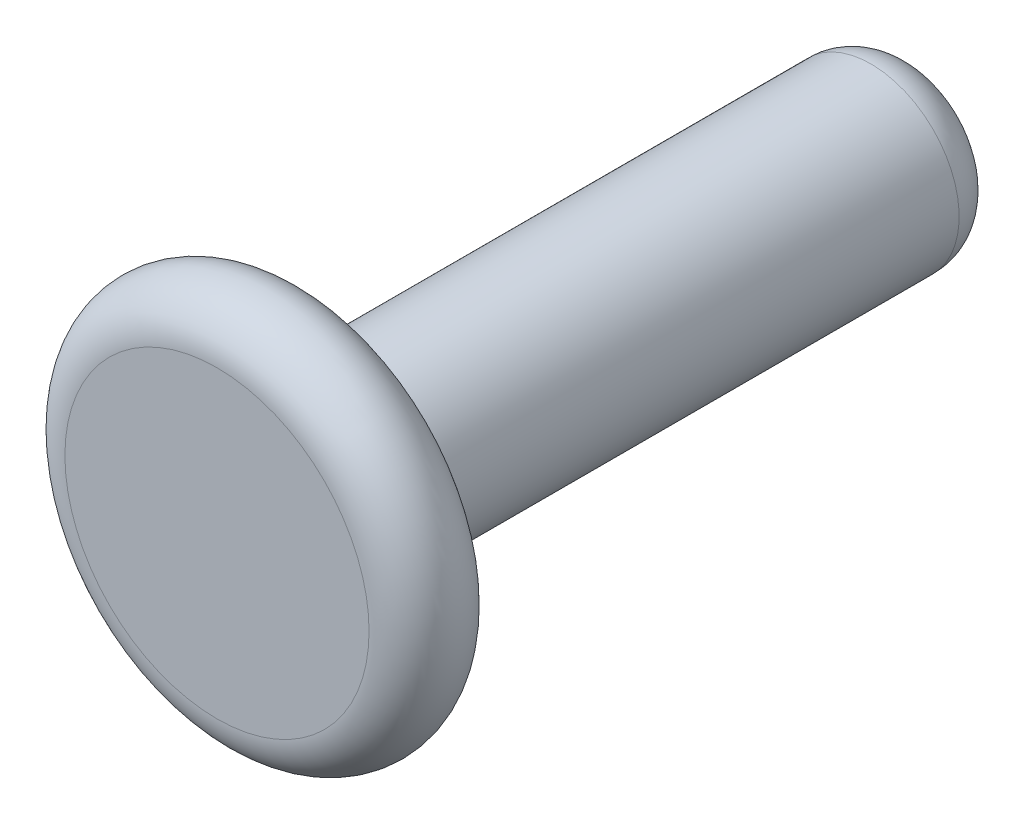
ISO-10303-21;
HEADER;
FILE_DESCRIPTION(('STEP AP214'),'2;1');
FILE_NAME('part.step','',(''),(''),'','','');
FILE_SCHEMA(('AUTOMOTIVE_DESIGN { 1 0 10303 214 1 1 1 1 }'));
ENDSEC;
DATA;
#1=APPLICATION_CONTEXT('core data for automotive mechanical design processes');
#2=APPLICATION_PROTOCOL_DEFINITION('international standard','automotive_design',2000,#1);
#3=PRODUCT_CONTEXT('',#1,'mechanical');
#4=PRODUCT('Part','Part','',(#3));
#5=PRODUCT_RELATED_PRODUCT_CATEGORY('part','',(#4));
#6=PRODUCT_DEFINITION_FORMATION('','',#4);
#7=PRODUCT_DEFINITION_CONTEXT('part definition',#1,'design');
#8=PRODUCT_DEFINITION('design','',#6,#7);
#9=PRODUCT_DEFINITION_SHAPE('','',#8);
#10=(LENGTH_UNIT() NAMED_UNIT(*) SI_UNIT(.MILLI.,.METRE.));
#11=(NAMED_UNIT(*) PLANE_ANGLE_UNIT() SI_UNIT($,.RADIAN.));
#12=(NAMED_UNIT(*) SI_UNIT($,.STERADIAN.) SOLID_ANGLE_UNIT());
#13=UNCERTAINTY_MEASURE_WITH_UNIT(LENGTH_MEASURE(1.E-05),#10,'distance_accuracy_value','');
#14=(GEOMETRIC_REPRESENTATION_CONTEXT(3) GLOBAL_UNCERTAINTY_ASSIGNED_CONTEXT((#13)) GLOBAL_UNIT_ASSIGNED_CONTEXT((#10,
#11,#12)) REPRESENTATION_CONTEXT('',''));
#15=CARTESIAN_POINT('',(0.,0.,0.));
#16=DIRECTION('',(0.,0.,1.));
#17=DIRECTION('',(1.,0.,0.));
#18=AXIS2_PLACEMENT_3D('',#15,#16,#17);
#19=CARTESIAN_POINT('',(0.,0.,4.25));
#20=DIRECTION('',(0.,0.,1.));
#21=DIRECTION('',(-1.,0.,0.));
#22=AXIS2_PLACEMENT_3D('',#19,#20,#21);
#23=DEGENERATE_TOROIDAL_SURFACE('',#22,0.7,0.75,.T.);
#24=CARTESIAN_POINT('',(0.,0.,3.5));
#25=DIRECTION('',(0.,0.,1.));
#26=DIRECTION('',(-1.,0.,0.));
#27=AXIS2_PLACEMENT_3D('',#24,#25,#26);
#28=CIRCLE('',#27,0.7);
#29=CARTESIAN_POINT('',(-0.7,0.,3.5));
#30=VERTEX_POINT('',#29);
#31=EDGE_CURVE('E26',#30,#30,#28,.T.);
#32=ORIENTED_EDGE('',*,*,#31,.T.);
#33=EDGE_LOOP('',(#32));
#34=FACE_BOUND('',#33,.T.);
#35=CARTESIAN_POINT('',(0.,0.,4.25));
#36=DIRECTION('',(0.,0.,1.));
#37=DIRECTION('',(-1.,0.,0.));
#38=AXIS2_PLACEMENT_3D('',#35,#36,#37);
#39=CIRCLE('',#38,1.45);
#40=CARTESIAN_POINT('',(-1.45,0.,4.25));
#41=VERTEX_POINT('',#40);
#42=EDGE_CURVE('E50',#41,#41,#39,.T.);
#43=ORIENTED_EDGE('',*,*,#42,.F.);
#44=EDGE_LOOP('',(#43));
#45=FACE_BOUND('',#44,.T.);
#46=ADVANCED_FACE('F16',(#34,#45),#23,.T.);
#47=CARTESIAN_POINT('',(0.,0.,14.25));
#48=DIRECTION('',(0.,0.,1.));
#49=DIRECTION('',(-1.,0.,0.));
#50=AXIS2_PLACEMENT_3D('',#47,#48,#49);
#51=TOROIDAL_SURFACE('',#50,2.5,0.75);
#52=CARTESIAN_POINT('',(0.,0.,15.));
#53=DIRECTION('',(0.,0.,1.));
#54=DIRECTION('',(-1.,0.,0.));
#55=AXIS2_PLACEMENT_3D('',#52,#53,#54);
#56=CIRCLE('',#55,2.5);
#57=CARTESIAN_POINT('',(-2.5,0.,15.));
#58=VERTEX_POINT('',#57);
#59=EDGE_CURVE('E11',#58,#58,#56,.T.);
#60=ORIENTED_EDGE('',*,*,#59,.F.);
#61=EDGE_LOOP('',(#60));
#62=FACE_BOUND('',#61,.T.);
#63=CARTESIAN_POINT('',(0.,0.,13.5));
#64=DIRECTION('',(0.,0.,1.));
#65=DIRECTION('',(-1.,0.,0.));
#66=AXIS2_PLACEMENT_3D('',#63,#64,#65);
#67=CIRCLE('',#66,2.5);
#68=CARTESIAN_POINT('',(-2.5,0.,13.5));
#69=VERTEX_POINT('',#68);
#70=EDGE_CURVE('E60',#69,#69,#67,.T.);
#71=ORIENTED_EDGE('',*,*,#70,.T.);
#72=EDGE_LOOP('',(#71));
#73=FACE_BOUND('',#72,.T.);
#74=ADVANCED_FACE('F18',(#62,#73),#51,.T.);
#75=CARTESIAN_POINT('',(0.,0.,15.));
#76=DIRECTION('',(0.,0.,1.));
#77=DIRECTION('',(1.,0.,0.));
#78=AXIS2_PLACEMENT_3D('',#75,#76,#77);
#79=PLANE('',#78);
#80=ORIENTED_EDGE('',*,*,#59,.T.);
#81=EDGE_LOOP('',(#80));
#82=FACE_BOUND('',#81,.T.);
#83=ADVANCED_FACE('F81',(#82),#79,.T.);
#84=CARTESIAN_POINT('',(0.,0.,3.5));
#85=DIRECTION('',(0.,0.,1.));
#86=DIRECTION('',(1.,0.,0.));
#87=AXIS2_PLACEMENT_3D('',#84,#85,#86);
#88=PLANE('',#87);
#89=ORIENTED_EDGE('',*,*,#31,.F.);
#90=EDGE_LOOP('',(#89));
#91=FACE_BOUND('',#90,.T.);
#92=ADVANCED_FACE('F72',(#91),#88,.F.);
#93=CARTESIAN_POINT('',(0.,0.,13.5));
#94=DIRECTION('',(0.,0.,1.));
#95=DIRECTION('',(1.,0.,0.));
#96=AXIS2_PLACEMENT_3D('',#93,#94,#95);
#97=PLANE('',#96);
#98=CARTESIAN_POINT('',(0.,0.,13.5));
#99=DIRECTION('',(0.,0.,1.));
#100=DIRECTION('',(-1.,0.,0.));
#101=AXIS2_PLACEMENT_3D('',#98,#99,#100);
#102=CIRCLE('',#101,1.45);
#103=CARTESIAN_POINT('',(-1.45,0.,13.5));
#104=VERTEX_POINT('',#103);
#105=EDGE_CURVE('E54',#104,#104,#102,.T.);
#106=ORIENTED_EDGE('',*,*,#105,.T.);
#107=EDGE_LOOP('',(#106));
#108=FACE_BOUND('',#107,.T.);
#109=ORIENTED_EDGE('',*,*,#70,.F.);
#110=EDGE_LOOP('',(#109));
#111=FACE_BOUND('',#110,.T.);
#112=ADVANCED_FACE('F70',(#108,#111),#97,.F.);
#113=CARTESIAN_POINT('',(0.,0.,0.));
#114=DIRECTION('',(0.,0.,1.));
#115=DIRECTION('',(-1.,0.,0.));
#116=AXIS2_PLACEMENT_3D('',#113,#114,#115);
#117=CYLINDRICAL_SURFACE('',#116,1.45);
#118=ORIENTED_EDGE('',*,*,#105,.F.);
#119=EDGE_LOOP('',(#118));
#120=FACE_BOUND('',#119,.T.);
#121=ORIENTED_EDGE('',*,*,#42,.T.);
#122=EDGE_LOOP('',(#121));
#123=FACE_BOUND('',#122,.T.);
#124=ADVANCED_FACE('F51',(#120,#123),#117,.T.);
#125=CLOSED_SHELL('',(#46,#74,#83,#92,#112,#124));
#126=MANIFOLD_SOLID_BREP('B1',#125);
#127=ADVANCED_BREP_SHAPE_REPRESENTATION('',(#18,#126),#14);
#128=SHAPE_DEFINITION_REPRESENTATION(#9,#127);
ENDSEC;
END-ISO-10303-21;
